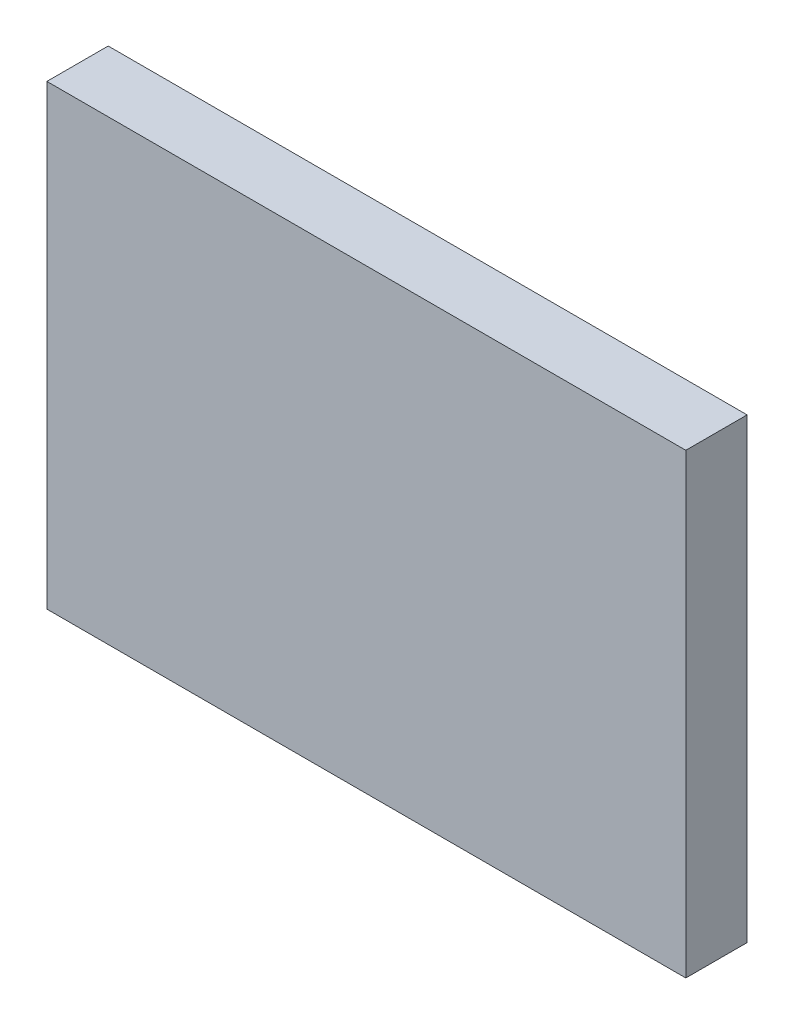
ISO-10303-21;
HEADER;
FILE_DESCRIPTION(('STEP AP214'),'2;1');
FILE_NAME('part.step','',(''),(''),'','','');
FILE_SCHEMA(('AUTOMOTIVE_DESIGN { 1 0 10303 214 1 1 1 1 }'));
ENDSEC;
DATA;
#1=APPLICATION_CONTEXT('core data for automotive mechanical design processes');
#2=APPLICATION_PROTOCOL_DEFINITION('international standard','automotive_design',2000,#1);
#3=PRODUCT_CONTEXT('',#1,'mechanical');
#4=PRODUCT('Part','Part','',(#3));
#5=PRODUCT_RELATED_PRODUCT_CATEGORY('part','',(#4));
#6=PRODUCT_DEFINITION_FORMATION('','',#4);
#7=PRODUCT_DEFINITION_CONTEXT('part definition',#1,'design');
#8=PRODUCT_DEFINITION('design','',#6,#7);
#9=PRODUCT_DEFINITION_SHAPE('','',#8);
#10=(LENGTH_UNIT() NAMED_UNIT(*) SI_UNIT(.MILLI.,.METRE.));
#11=(NAMED_UNIT(*) PLANE_ANGLE_UNIT() SI_UNIT($,.RADIAN.));
#12=(NAMED_UNIT(*) SI_UNIT($,.STERADIAN.) SOLID_ANGLE_UNIT());
#13=UNCERTAINTY_MEASURE_WITH_UNIT(LENGTH_MEASURE(1.E-05),#10,'distance_accuracy_value','');
#14=(GEOMETRIC_REPRESENTATION_CONTEXT(3) GLOBAL_UNCERTAINTY_ASSIGNED_CONTEXT((#13)) GLOBAL_UNIT_ASSIGNED_CONTEXT((#10,
#11,#12)) REPRESENTATION_CONTEXT('',''));
#15=CARTESIAN_POINT('',(0.,0.,0.));
#16=DIRECTION('',(0.,0.,1.));
#17=DIRECTION('',(1.,0.,0.));
#18=AXIS2_PLACEMENT_3D('',#15,#16,#17);
#19=CARTESIAN_POINT('',(0.649751313264501,-0.604008281971269,0.));
#20=DIRECTION('',(-1.,0.,0.));
#21=DIRECTION('',(0.,-1.,0.));
#22=AXIS2_PLACEMENT_3D('',#19,#20,#21);
#23=PLANE('',#22);
#24=DIRECTION('',(0.,-1.,0.));
#25=VECTOR('',#24,1.);
#26=CARTESIAN_POINT('',(0.649751313264501,-0.604008281971269,0.));
#27=LINE('',#26,#25);
#28=CARTESIAN_POINT('',(0.649751313264501,-0.604008281971269,0.));
#29=VERTEX_POINT('',#28);
#30=CARTESIAN_POINT('',(0.649751313264501,-0.626373786984169,0.));
#31=VERTEX_POINT('',#30);
#32=EDGE_CURVE('E11',#29,#31,#27,.T.);
#33=ORIENTED_EDGE('',*,*,#32,.T.);
#34=DIRECTION('',(0.,0.,1.));
#35=VECTOR('',#34,1.);
#36=CARTESIAN_POINT('',(0.649751313264501,-0.626373786984169,0.));
#37=LINE('',#36,#35);
#38=CARTESIAN_POINT('',(0.649751313264501,-0.626373786984169,0.003));
#39=VERTEX_POINT('',#38);
#40=EDGE_CURVE('E24',#31,#39,#37,.T.);
#41=ORIENTED_EDGE('',*,*,#40,.T.);
#42=DIRECTION('',(0.,-1.,0.));
#43=VECTOR('',#42,1.);
#44=CARTESIAN_POINT('',(0.649751313264501,-0.604008281971269,0.003));
#45=LINE('',#44,#43);
#46=CARTESIAN_POINT('',(0.649751313264501,-0.604008281971269,0.003));
#47=VERTEX_POINT('',#46);
#48=EDGE_CURVE('E75',#47,#39,#45,.T.);
#49=ORIENTED_EDGE('',*,*,#48,.F.);
#50=DIRECTION('',(0.,0.,1.));
#51=VECTOR('',#50,1.);
#52=CARTESIAN_POINT('',(0.649751313264501,-0.604008281971269,0.));
#53=LINE('',#52,#51);
#54=EDGE_CURVE('E86',#29,#47,#53,.T.);
#55=ORIENTED_EDGE('',*,*,#54,.F.);
#56=EDGE_LOOP('',(#33,#41,#49,#55));
#57=FACE_BOUND('',#56,.T.);
#58=ADVANCED_FACE('F17',(#57),#23,.T.);
#59=CARTESIAN_POINT('',(0.681017376394782,-0.604008281971269,0.));
#60=DIRECTION('',(0.,1.,0.));
#61=DIRECTION('',(-1.,0.,0.));
#62=AXIS2_PLACEMENT_3D('',#59,#60,#61);
#63=PLANE('',#62);
#64=DIRECTION('',(-1.,0.,0.));
#65=VECTOR('',#64,1.);
#66=CARTESIAN_POINT('',(0.681017376394782,-0.604008281971269,0.));
#67=LINE('',#66,#65);
#68=CARTESIAN_POINT('',(0.681017376394782,-0.604008281971269,0.));
#69=VERTEX_POINT('',#68);
#70=EDGE_CURVE('E83',#69,#29,#67,.T.);
#71=ORIENTED_EDGE('',*,*,#70,.T.);
#72=ORIENTED_EDGE('',*,*,#54,.T.);
#73=DIRECTION('',(-1.,0.,0.));
#74=VECTOR('',#73,1.);
#75=CARTESIAN_POINT('',(0.681017376394782,-0.604008281971269,0.003));
#76=LINE('',#75,#74);
#77=CARTESIAN_POINT('',(0.681017376394782,-0.604008281971269,0.003));
#78=VERTEX_POINT('',#77);
#79=EDGE_CURVE('E81',#78,#47,#76,.T.);
#80=ORIENTED_EDGE('',*,*,#79,.F.);
#81=DIRECTION('',(0.,0.,1.));
#82=VECTOR('',#81,1.);
#83=CARTESIAN_POINT('',(0.681017376394782,-0.604008281971269,0.));
#84=LINE('',#83,#82);
#85=EDGE_CURVE('E61',#69,#78,#84,.T.);
#86=ORIENTED_EDGE('',*,*,#85,.F.);
#87=EDGE_LOOP('',(#71,#72,#80,#86));
#88=FACE_BOUND('',#87,.T.);
#89=ADVANCED_FACE('F91',(#88),#63,.T.);
#90=CARTESIAN_POINT('',(0.681017376394782,-0.626373786984169,0.));
#91=DIRECTION('',(1.,0.,0.));
#92=DIRECTION('',(0.,1.,0.));
#93=AXIS2_PLACEMENT_3D('',#90,#91,#92);
#94=PLANE('',#93);
#95=DIRECTION('',(0.,1.,0.));
#96=VECTOR('',#95,1.);
#97=CARTESIAN_POINT('',(0.681017376394782,-0.626373786984169,0.));
#98=LINE('',#97,#96);
#99=CARTESIAN_POINT('',(0.681017376394782,-0.626373786984169,0.));
#100=VERTEX_POINT('',#99);
#101=EDGE_CURVE('E65',#100,#69,#98,.T.);
#102=ORIENTED_EDGE('',*,*,#101,.T.);
#103=ORIENTED_EDGE('',*,*,#85,.T.);
#104=DIRECTION('',(0.,1.,0.));
#105=VECTOR('',#104,1.);
#106=CARTESIAN_POINT('',(0.681017376394782,-0.626373786984169,0.003));
#107=LINE('',#106,#105);
#108=CARTESIAN_POINT('',(0.681017376394782,-0.626373786984169,0.003));
#109=VERTEX_POINT('',#108);
#110=EDGE_CURVE('E54',#109,#78,#107,.T.);
#111=ORIENTED_EDGE('',*,*,#110,.F.);
#112=DIRECTION('',(0.,0.,1.));
#113=VECTOR('',#112,1.);
#114=CARTESIAN_POINT('',(0.681017376394782,-0.626373786984169,0.));
#115=LINE('',#114,#113);
#116=EDGE_CURVE('E58',#100,#109,#115,.T.);
#117=ORIENTED_EDGE('',*,*,#116,.F.);
#118=EDGE_LOOP('',(#102,#103,#111,#117));
#119=FACE_BOUND('',#118,.T.);
#120=ADVANCED_FACE('F57',(#119),#94,.T.);
#121=CARTESIAN_POINT('',(0.649751313264501,-0.626373786984169,0.));
#122=DIRECTION('',(0.,-1.,0.));
#123=DIRECTION('',(1.,0.,0.));
#124=AXIS2_PLACEMENT_3D('',#121,#122,#123);
#125=PLANE('',#124);
#126=DIRECTION('',(1.,0.,0.));
#127=VECTOR('',#126,1.);
#128=CARTESIAN_POINT('',(0.649751313264501,-0.626373786984169,0.));
#129=LINE('',#128,#127);
#130=EDGE_CURVE('E71',#31,#100,#129,.T.);
#131=ORIENTED_EDGE('',*,*,#130,.T.);
#132=ORIENTED_EDGE('',*,*,#116,.T.);
#133=DIRECTION('',(1.,0.,0.));
#134=VECTOR('',#133,1.);
#135=CARTESIAN_POINT('',(0.649751313264501,-0.626373786984169,0.003));
#136=LINE('',#135,#134);
#137=EDGE_CURVE('E70',#39,#109,#136,.T.);
#138=ORIENTED_EDGE('',*,*,#137,.F.);
#139=ORIENTED_EDGE('',*,*,#40,.F.);
#140=EDGE_LOOP('',(#131,#132,#138,#139));
#141=FACE_BOUND('',#140,.T.);
#142=ADVANCED_FACE('F69',(#141),#125,.T.);
#143=CARTESIAN_POINT('',(0.665384344829641,-0.615191034477719,0.003));
#144=DIRECTION('',(0.,0.,1.));
#145=DIRECTION('',(1.,0.,0.));
#146=AXIS2_PLACEMENT_3D('',#143,#144,#145);
#147=PLANE('',#146);
#148=ORIENTED_EDGE('',*,*,#137,.T.);
#149=ORIENTED_EDGE('',*,*,#110,.T.);
#150=ORIENTED_EDGE('',*,*,#79,.T.);
#151=ORIENTED_EDGE('',*,*,#48,.T.);
#152=EDGE_LOOP('',(#148,#149,#150,#151));
#153=FACE_BOUND('',#152,.T.);
#154=ADVANCED_FACE('F74',(#153),#147,.T.);
#155=CARTESIAN_POINT('',(0.665384344829641,-0.615191034477719,0.));
#156=DIRECTION('',(0.,0.,1.));
#157=DIRECTION('',(1.,0.,0.));
#158=AXIS2_PLACEMENT_3D('',#155,#156,#157);
#159=PLANE('',#158);
#160=ORIENTED_EDGE('',*,*,#130,.F.);
#161=ORIENTED_EDGE('',*,*,#32,.F.);
#162=ORIENTED_EDGE('',*,*,#70,.F.);
#163=ORIENTED_EDGE('',*,*,#101,.F.);
#164=EDGE_LOOP('',(#160,#161,#162,#163));
#165=FACE_BOUND('',#164,.T.);
#166=ADVANCED_FACE('F89',(#165),#159,.F.);
#167=CLOSED_SHELL('',(#58,#89,#120,#142,#154,#166));
#168=MANIFOLD_SOLID_BREP('B1',#167);
#169=ADVANCED_BREP_SHAPE_REPRESENTATION('',(#18,#168),#14);
#170=SHAPE_DEFINITION_REPRESENTATION(#9,#169);
ENDSEC;
END-ISO-10303-21;
